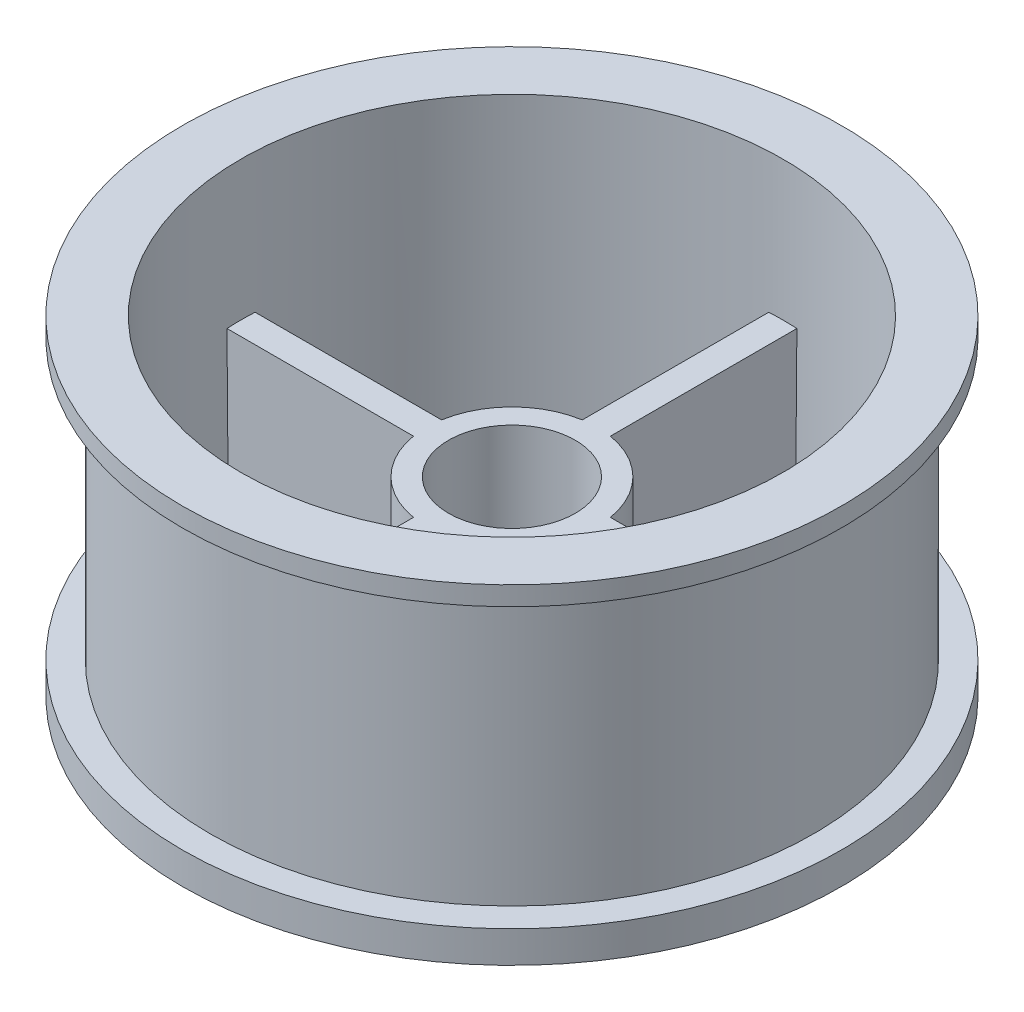
ISO-10303-21;
HEADER;
FILE_DESCRIPTION(('STEP AP214'),'2;1');
FILE_NAME('part.step','',(''),(''),'','','');
FILE_SCHEMA(('AUTOMOTIVE_DESIGN { 1 0 10303 214 1 1 1 1 }'));
ENDSEC;
DATA;
#1=APPLICATION_CONTEXT('core data for automotive mechanical design processes');
#2=APPLICATION_PROTOCOL_DEFINITION('international standard','automotive_design',2000,#1);
#3=PRODUCT_CONTEXT('',#1,'mechanical');
#4=PRODUCT('Part','Part','',(#3));
#5=PRODUCT_RELATED_PRODUCT_CATEGORY('part','',(#4));
#6=PRODUCT_DEFINITION_FORMATION('','',#4);
#7=PRODUCT_DEFINITION_CONTEXT('part definition',#1,'design');
#8=PRODUCT_DEFINITION('design','',#6,#7);
#9=PRODUCT_DEFINITION_SHAPE('','',#8);
#10=(LENGTH_UNIT() NAMED_UNIT(*) SI_UNIT(.MILLI.,.METRE.));
#11=(NAMED_UNIT(*) PLANE_ANGLE_UNIT() SI_UNIT($,.RADIAN.));
#12=(NAMED_UNIT(*) SI_UNIT($,.STERADIAN.) SOLID_ANGLE_UNIT());
#13=UNCERTAINTY_MEASURE_WITH_UNIT(LENGTH_MEASURE(1.E-05),#10,'distance_accuracy_value','');
#14=(GEOMETRIC_REPRESENTATION_CONTEXT(3) GLOBAL_UNCERTAINTY_ASSIGNED_CONTEXT((#13)) GLOBAL_UNIT_ASSIGNED_CONTEXT((#10,
#11,#12)) REPRESENTATION_CONTEXT('',''));
#15=CARTESIAN_POINT('',(0.,0.,0.));
#16=DIRECTION('',(0.,0.,1.));
#17=DIRECTION('',(1.,0.,0.));
#18=AXIS2_PLACEMENT_3D('',#15,#16,#17);
#19=CARTESIAN_POINT('',(0.,2.5,-21.4));
#20=DIRECTION('',(0.,-1.,0.));
#21=DIRECTION('',(0.,0.,-1.));
#22=AXIS2_PLACEMENT_3D('',#19,#20,#21);
#23=PLANE('',#22);
#24=CARTESIAN_POINT('',(9.89949493661167,2.5,-9.89949493661167));
#25=DIRECTION('',(0.,1.,0.));
#26=DIRECTION('',(0.,0.,1.));
#27=AXIS2_PLACEMENT_3D('',#24,#25,#26);
#28=CIRCLE('',#27,6.5);
#29=CARTESIAN_POINT('',(9.89949493661167,2.5,-3.39949493661167));
#30=VERTEX_POINT('',#29);
#31=EDGE_CURVE('E566',#30,#30,#28,.T.);
#32=ORIENTED_EDGE('',*,*,#31,.F.);
#33=EDGE_LOOP('',(#32));
#34=FACE_BOUND('',#33,.T.);
#35=DIRECTION('',(1.,0.,0.));
#36=VECTOR('',#35,1.);
#37=CARTESIAN_POINT('',(0.,2.5,-1.));
#38=LINE('',#37,#36);
#39=CARTESIAN_POINT('',(21.3766227454198,2.5,-1.));
#40=VERTEX_POINT('',#39);
#41=CARTESIAN_POINT('',(6.67551496140934,2.50000000000001,-1.));
#42=VERTEX_POINT('',#41);
#43=EDGE_CURVE('E164',#40,#42,#38,.F.);
#44=ORIENTED_EDGE('',*,*,#43,.F.);
#45=CARTESIAN_POINT('',(0.,2.50000000000001,0.));
#46=DIRECTION('',(0.,1.,0.));
#47=DIRECTION('',(0.,0.,1.));
#48=AXIS2_PLACEMENT_3D('',#45,#46,#47);
#49=CIRCLE('',#48,21.4);
#50=CARTESIAN_POINT('',(1.,2.5,-21.3766227454198));
#51=VERTEX_POINT('',#50);
#52=EDGE_CURVE('E184',#40,#51,#49,.T.);
#53=ORIENTED_EDGE('',*,*,#52,.T.);
#54=DIRECTION('',(0.,0.,1.));
#55=VECTOR('',#54,1.);
#56=CARTESIAN_POINT('',(1.,2.5,-21.4));
#57=LINE('',#56,#55);
#58=CARTESIAN_POINT('',(1.,2.50000000000001,-6.67551496140934));
#59=VERTEX_POINT('',#58);
#60=EDGE_CURVE('E299',#59,#51,#57,.F.);
#61=ORIENTED_EDGE('',*,*,#60,.F.);
#62=CARTESIAN_POINT('',(0.,2.5,0.));
#63=DIRECTION('',(0.,-1.,0.));
#64=DIRECTION('',(0.,0.,-1.));
#65=AXIS2_PLACEMENT_3D('',#62,#63,#64);
#66=CIRCLE('',#65,6.75);
#67=EDGE_CURVE('E221',#42,#59,#66,.F.);
#68=ORIENTED_EDGE('',*,*,#67,.F.);
#69=EDGE_LOOP('',(#44,#53,#61,#68));
#70=FACE_BOUND('',#69,.T.);
#71=ADVANCED_FACE('F37',(#34,#70),#23,.F.);
#72=CARTESIAN_POINT('',(0.,15.,0.));
#73=DIRECTION('',(0.,-1.,0.));
#74=DIRECTION('',(0.,0.,-1.));
#75=AXIS2_PLACEMENT_3D('',#72,#73,#74);
#76=CYLINDRICAL_SURFACE('',#75,6.75);
#77=CARTESIAN_POINT('',(0.,-112.088650129309,0.));
#78=DIRECTION('',(0.,-0.0087265354983741,-0.999961923064171));
#79=DIRECTION('',(0.,-0.999961923064171,0.0087265354983741));
#80=AXIS2_PLACEMENT_3D('',#77,#78,#79);
#81=ELLIPSE('',#80,773.502840990878,6.75);
#82=CARTESIAN_POINT('',(6.65826017688791,15.,-1.10908584738449));
#83=VERTEX_POINT('',#82);
#84=EDGE_CURVE('E162',#42,#83,#81,.F.);
#85=ORIENTED_EDGE('',*,*,#84,.F.);
#86=ORIENTED_EDGE('',*,*,#67,.T.);
#87=CARTESIAN_POINT('',(0.,-112.088650129309,0.));
#88=DIRECTION('',(0.999961923064171,-0.00872653549837395,0.));
#89=DIRECTION('',(-0.00872653549837395,-0.999961923064171,0.));
#90=AXIS2_PLACEMENT_3D('',#87,#88,#89);
#91=ELLIPSE('',#90,773.502840990878,6.75);
#92=CARTESIAN_POINT('',(1.10908584738449,15.,-6.65826017688791));
#93=VERTEX_POINT('',#92);
#94=EDGE_CURVE('E172',#59,#93,#91,.T.);
#95=ORIENTED_EDGE('',*,*,#94,.T.);
#96=CARTESIAN_POINT('',(0.,15.,0.));
#97=DIRECTION('',(0.,1.,0.));
#98=DIRECTION('',(0.,0.,1.));
#99=AXIS2_PLACEMENT_3D('',#96,#97,#98);
#100=CIRCLE('',#99,6.75);
#101=EDGE_CURVE('E155',#83,#93,#100,.T.);
#102=ORIENTED_EDGE('',*,*,#101,.F.);
#103=EDGE_LOOP('',(#85,#86,#95,#102));
#104=FACE_BOUND('',#103,.T.);
#105=ADVANCED_FACE('F170',(#104),#76,.T.);
#106=CARTESIAN_POINT('',(-9.89949493661167,2.5,9.89949493661167));
#107=DIRECTION('',(0.,1.,0.));
#108=DIRECTION('',(0.,0.,-1.));
#109=AXIS2_PLACEMENT_3D('',#106,#107,#108);
#110=CIRCLE('',#109,6.5);
#111=CARTESIAN_POINT('',(-9.89949493661167,2.5,3.39949493661167));
#112=VERTEX_POINT('',#111);
#113=EDGE_CURVE('E564',#112,#112,#110,.T.);
#114=ORIENTED_EDGE('',*,*,#113,.F.);
#115=EDGE_LOOP('',(#114));
#116=FACE_BOUND('',#115,.T.);
#117=DIRECTION('',(-1.,0.,0.));
#118=VECTOR('',#117,1.);
#119=CARTESIAN_POINT('',(0.,2.5,1.));
#120=LINE('',#119,#118);
#121=CARTESIAN_POINT('',(-21.3766227454198,2.5,1.));
#122=VERTEX_POINT('',#121);
#123=CARTESIAN_POINT('',(-6.67551496140934,2.50000000000001,1.));
#124=VERTEX_POINT('',#123);
#125=EDGE_CURVE('E253',#122,#124,#120,.F.);
#126=ORIENTED_EDGE('',*,*,#125,.F.);
#127=CARTESIAN_POINT('',(-1.,2.50000000000001,21.3766227454198));
#128=VERTEX_POINT('',#127);
#129=EDGE_CURVE('E187',#122,#128,#49,.T.);
#130=ORIENTED_EDGE('',*,*,#129,.T.);
#131=DIRECTION('',(0.,0.,-1.));
#132=VECTOR('',#131,1.);
#133=CARTESIAN_POINT('',(-1.,2.5,-21.4));
#134=LINE('',#133,#132);
#135=CARTESIAN_POINT('',(-1.,2.50000000000001,6.67551496140934));
#136=VERTEX_POINT('',#135);
#137=EDGE_CURVE('E284',#136,#128,#134,.F.);
#138=ORIENTED_EDGE('',*,*,#137,.F.);
#139=EDGE_CURVE('E226',#124,#136,#66,.F.);
#140=ORIENTED_EDGE('',*,*,#139,.F.);
#141=EDGE_LOOP('',(#126,#130,#138,#140));
#142=FACE_BOUND('',#141,.T.);
#143=ADVANCED_FACE('F327',(#116,#142),#23,.F.);
#144=CARTESIAN_POINT('',(0.,-112.088650129309,0.));
#145=DIRECTION('',(0.,-0.00872653549837381,0.999961923064171));
#146=DIRECTION('',(0.,-0.999961923064171,-0.00872653549837381));
#147=AXIS2_PLACEMENT_3D('',#144,#145,#146);
#148=ELLIPSE('',#147,773.502840990878,6.75);
#149=CARTESIAN_POINT('',(-6.65826017688791,15.,1.10908584738448));
#150=VERTEX_POINT('',#149);
#151=EDGE_CURVE('E263',#124,#150,#148,.F.);
#152=ORIENTED_EDGE('',*,*,#151,.F.);
#153=ORIENTED_EDGE('',*,*,#139,.T.);
#154=CARTESIAN_POINT('',(0.,-112.088650129309,0.));
#155=DIRECTION('',(-0.999961923064171,-0.00872653549837395,0.));
#156=DIRECTION('',(0.00872653549837395,-0.999961923064171,0.));
#157=AXIS2_PLACEMENT_3D('',#154,#155,#156);
#158=ELLIPSE('',#157,773.502840990878,6.75);
#159=CARTESIAN_POINT('',(-1.10908584738449,15.,6.65826017688791));
#160=VERTEX_POINT('',#159);
#161=EDGE_CURVE('E276',#136,#160,#158,.T.);
#162=ORIENTED_EDGE('',*,*,#161,.T.);
#163=EDGE_CURVE('E176',#150,#160,#100,.T.);
#164=ORIENTED_EDGE('',*,*,#163,.F.);
#165=EDGE_LOOP('',(#152,#153,#162,#164));
#166=FACE_BOUND('',#165,.T.);
#167=ADVANCED_FACE('F332',(#166),#76,.T.);
#168=CARTESIAN_POINT('',(9.89949493661165,2.5,9.89949493661166));
#169=DIRECTION('',(0.,1.,0.));
#170=DIRECTION('',(0.,0.,-1.));
#171=AXIS2_PLACEMENT_3D('',#168,#169,#170);
#172=CIRCLE('',#171,6.5);
#173=CARTESIAN_POINT('',(9.89949493661165,2.5,3.39949493661166));
#174=VERTEX_POINT('',#173);
#175=EDGE_CURVE('E357',#174,#174,#172,.T.);
#176=ORIENTED_EDGE('',*,*,#175,.F.);
#177=EDGE_LOOP('',(#176));
#178=FACE_BOUND('',#177,.T.);
#179=DIRECTION('',(-1.,0.,0.));
#180=VECTOR('',#179,1.);
#181=CARTESIAN_POINT('',(0.,2.5,1.));
#182=LINE('',#181,#180);
#183=CARTESIAN_POINT('',(6.67551496140934,2.50000000000001,1.));
#184=VERTEX_POINT('',#183);
#185=CARTESIAN_POINT('',(21.3766227454198,2.5,1.));
#186=VERTEX_POINT('',#185);
#187=EDGE_CURVE('E256',#184,#186,#182,.F.);
#188=ORIENTED_EDGE('',*,*,#187,.F.);
#189=CARTESIAN_POINT('',(1.,2.50000000000001,6.67551496140934));
#190=VERTEX_POINT('',#189);
#191=EDGE_CURVE('E227',#190,#184,#66,.F.);
#192=ORIENTED_EDGE('',*,*,#191,.F.);
#193=DIRECTION('',(0.,0.,1.));
#194=VECTOR('',#193,1.);
#195=CARTESIAN_POINT('',(1.,2.5,-21.4));
#196=LINE('',#195,#194);
#197=CARTESIAN_POINT('',(1.,2.50000000000001,21.3766227454198));
#198=VERTEX_POINT('',#197);
#199=EDGE_CURVE('E282',#198,#190,#196,.F.);
#200=ORIENTED_EDGE('',*,*,#199,.F.);
#201=EDGE_CURVE('E186',#198,#186,#49,.T.);
#202=ORIENTED_EDGE('',*,*,#201,.T.);
#203=EDGE_LOOP('',(#188,#192,#200,#202));
#204=FACE_BOUND('',#203,.T.);
#205=ADVANCED_FACE('F337',(#178,#204),#23,.F.);
#206=ORIENTED_EDGE('',*,*,#191,.T.);
#207=CARTESIAN_POINT('',(0.,-112.088650129309,0.));
#208=DIRECTION('',(0.,-0.00872653549837381,0.999961923064171));
#209=DIRECTION('',(0.,-0.999961923064171,-0.00872653549837381));
#210=AXIS2_PLACEMENT_3D('',#207,#208,#209);
#211=ELLIPSE('',#210,773.502840990878,6.75);
#212=CARTESIAN_POINT('',(6.65826017688791,15.,1.10908584738448));
#213=VERTEX_POINT('',#212);
#214=EDGE_CURVE('E167',#184,#213,#211,.T.);
#215=ORIENTED_EDGE('',*,*,#214,.T.);
#216=CARTESIAN_POINT('',(1.10908584738449,15.,6.65826017688791));
#217=VERTEX_POINT('',#216);
#218=EDGE_CURVE('E173',#217,#213,#100,.T.);
#219=ORIENTED_EDGE('',*,*,#218,.F.);
#220=CARTESIAN_POINT('',(0.,-112.088650129309,0.));
#221=DIRECTION('',(0.999961923064171,-0.00872653549837395,0.));
#222=DIRECTION('',(-0.00872653549837395,-0.999961923064171,0.));
#223=AXIS2_PLACEMENT_3D('',#220,#221,#222);
#224=ELLIPSE('',#223,773.502840990878,6.75);
#225=EDGE_CURVE('E279',#190,#217,#224,.F.);
#226=ORIENTED_EDGE('',*,*,#225,.F.);
#227=EDGE_LOOP('',(#206,#215,#219,#226));
#228=FACE_BOUND('',#227,.T.);
#229=ADVANCED_FACE('F323',(#228),#76,.T.);
#230=CARTESIAN_POINT('',(-9.89949493661166,2.5,-9.89949493661167));
#231=DIRECTION('',(0.,1.,0.));
#232=DIRECTION('',(0.,0.,1.));
#233=AXIS2_PLACEMENT_3D('',#230,#231,#232);
#234=CIRCLE('',#233,6.5);
#235=CARTESIAN_POINT('',(-9.89949493661166,2.5,-3.39949493661167));
#236=VERTEX_POINT('',#235);
#237=EDGE_CURVE('E577',#236,#236,#234,.T.);
#238=ORIENTED_EDGE('',*,*,#237,.F.);
#239=EDGE_LOOP('',(#238));
#240=FACE_BOUND('',#239,.T.);
#241=DIRECTION('',(1.,0.,0.));
#242=VECTOR('',#241,1.);
#243=CARTESIAN_POINT('',(0.,2.5,-1.));
#244=LINE('',#243,#242);
#245=CARTESIAN_POINT('',(-6.67551496140934,2.50000000000001,-1.));
#246=VERTEX_POINT('',#245);
#247=CARTESIAN_POINT('',(-21.3766227454198,2.5,-1.));
#248=VERTEX_POINT('',#247);
#249=EDGE_CURVE('E245',#246,#248,#244,.F.);
#250=ORIENTED_EDGE('',*,*,#249,.F.);
#251=CARTESIAN_POINT('',(-1.,2.50000000000001,-6.67551496140934));
#252=VERTEX_POINT('',#251);
#253=EDGE_CURVE('E222',#252,#246,#66,.F.);
#254=ORIENTED_EDGE('',*,*,#253,.F.);
#255=DIRECTION('',(0.,0.,-1.));
#256=VECTOR('',#255,1.);
#257=CARTESIAN_POINT('',(-1.,2.5,-21.4));
#258=LINE('',#257,#256);
#259=CARTESIAN_POINT('',(-1.,2.5,-21.3766227454198));
#260=VERTEX_POINT('',#259);
#261=EDGE_CURVE('E295',#260,#252,#258,.F.);
#262=ORIENTED_EDGE('',*,*,#261,.F.);
#263=EDGE_CURVE('E188',#260,#248,#49,.T.);
#264=ORIENTED_EDGE('',*,*,#263,.T.);
#265=EDGE_LOOP('',(#250,#254,#262,#264));
#266=FACE_BOUND('',#265,.T.);
#267=ADVANCED_FACE('F328',(#240,#266),#23,.F.);
#268=CARTESIAN_POINT('',(0.,0.,0.));
#269=DIRECTION('',(0.,1.,0.));
#270=DIRECTION('',(0.,0.,1.));
#271=AXIS2_PLACEMENT_3D('',#268,#269,#270);
#272=PLANE('',#271);
#273=CARTESIAN_POINT('',(-9.89949493661167,0.,9.89949493661167));
#274=DIRECTION('',(0.,1.,0.));
#275=DIRECTION('',(0.,0.,-1.));
#276=AXIS2_PLACEMENT_3D('',#273,#274,#275);
#277=CIRCLE('',#276,6.5);
#278=CARTESIAN_POINT('',(-9.89949493661167,0.,3.39949493661167));
#279=VERTEX_POINT('',#278);
#280=EDGE_CURVE('E561',#279,#279,#277,.T.);
#281=ORIENTED_EDGE('',*,*,#280,.T.);
#282=EDGE_LOOP('',(#281));
#283=FACE_BOUND('',#282,.T.);
#284=CARTESIAN_POINT('',(9.89949493661167,0.,-9.89949493661167));
#285=DIRECTION('',(0.,1.,0.));
#286=DIRECTION('',(0.,0.,1.));
#287=AXIS2_PLACEMENT_3D('',#284,#285,#286);
#288=CIRCLE('',#287,6.5);
#289=CARTESIAN_POINT('',(9.89949493661167,0.,-3.39949493661167));
#290=VERTEX_POINT('',#289);
#291=EDGE_CURVE('E569',#290,#290,#288,.T.);
#292=ORIENTED_EDGE('',*,*,#291,.T.);
#293=EDGE_LOOP('',(#292));
#294=FACE_BOUND('',#293,.T.);
#295=CARTESIAN_POINT('',(9.89949493661165,0.,9.89949493661166));
#296=DIRECTION('',(0.,1.,0.));
#297=DIRECTION('',(0.,0.,-1.));
#298=AXIS2_PLACEMENT_3D('',#295,#296,#297);
#299=CIRCLE('',#298,6.5);
#300=CARTESIAN_POINT('',(9.89949493661165,0.,3.39949493661166));
#301=VERTEX_POINT('',#300);
#302=EDGE_CURVE('E574',#301,#301,#299,.T.);
#303=ORIENTED_EDGE('',*,*,#302,.T.);
#304=EDGE_LOOP('',(#303));
#305=FACE_BOUND('',#304,.T.);
#306=CARTESIAN_POINT('',(-9.89949493661166,0.,-9.89949493661167));
#307=DIRECTION('',(0.,1.,0.));
#308=DIRECTION('',(0.,0.,1.));
#309=AXIS2_PLACEMENT_3D('',#306,#307,#308);
#310=CIRCLE('',#309,6.5);
#311=CARTESIAN_POINT('',(-9.89949493661166,0.,-3.39949493661167));
#312=VERTEX_POINT('',#311);
#313=EDGE_CURVE('E579',#312,#312,#310,.T.);
#314=ORIENTED_EDGE('',*,*,#313,.T.);
#315=EDGE_LOOP('',(#314));
#316=FACE_BOUND('',#315,.T.);
#317=CARTESIAN_POINT('',(0.,0.,0.));
#318=DIRECTION('',(0.,1.,0.));
#319=DIRECTION('',(0.,0.,1.));
#320=AXIS2_PLACEMENT_3D('',#317,#318,#319);
#321=CIRCLE('',#320,4.25);
#322=CARTESIAN_POINT('',(0.,0.,4.25));
#323=VERTEX_POINT('',#322);
#324=EDGE_CURVE('E302',#323,#323,#321,.T.);
#325=ORIENTED_EDGE('',*,*,#324,.T.);
#326=EDGE_LOOP('',(#325));
#327=FACE_BOUND('',#326,.T.);
#328=CARTESIAN_POINT('',(0.,0.,0.));
#329=DIRECTION('',(0.,1.,0.));
#330=DIRECTION('',(0.,0.,1.));
#331=AXIS2_PLACEMENT_3D('',#328,#329,#330);
#332=CIRCLE('',#331,26.);
#333=CARTESIAN_POINT('',(0.,0.,26.));
#334=VERTEX_POINT('',#333);
#335=EDGE_CURVE('E218',#334,#334,#332,.T.);
#336=ORIENTED_EDGE('',*,*,#335,.F.);
#337=EDGE_LOOP('',(#336));
#338=FACE_BOUND('',#337,.T.);
#339=ADVANCED_FACE('F39',(#283,#294,#305,#316,#327,#338),#272,.F.);
#340=CARTESIAN_POINT('',(0.,2.5,0.));
#341=DIRECTION('',(0.,1.,0.));
#342=DIRECTION('',(0.,0.,1.));
#343=AXIS2_PLACEMENT_3D('',#340,#341,#342);
#344=CYLINDRICAL_SURFACE('',#343,26.);
#345=ORIENTED_EDGE('',*,*,#335,.T.);
#346=EDGE_LOOP('',(#345));
#347=FACE_BOUND('',#346,.T.);
#348=CARTESIAN_POINT('',(0.,2.5,0.));
#349=DIRECTION('',(0.,1.,0.));
#350=DIRECTION('',(0.,0.,1.));
#351=AXIS2_PLACEMENT_3D('',#348,#349,#350);
#352=CIRCLE('',#351,26.);
#353=CARTESIAN_POINT('',(0.,2.50000000000001,26.));
#354=VERTEX_POINT('',#353);
#355=EDGE_CURVE('E215',#354,#354,#352,.T.);
#356=ORIENTED_EDGE('',*,*,#355,.F.);
#357=EDGE_LOOP('',(#356));
#358=FACE_BOUND('',#357,.T.);
#359=ADVANCED_FACE('F344',(#347,#358),#344,.T.);
#360=CARTESIAN_POINT('',(0.,2.5,-26.));
#361=DIRECTION('',(0.,-1.,0.));
#362=DIRECTION('',(0.,0.,-1.));
#363=AXIS2_PLACEMENT_3D('',#360,#361,#362);
#364=PLANE('',#363);
#365=ORIENTED_EDGE('',*,*,#355,.T.);
#366=EDGE_LOOP('',(#365));
#367=FACE_BOUND('',#366,.T.);
#368=CARTESIAN_POINT('',(0.,2.5,0.));
#369=DIRECTION('',(0.,1.,0.));
#370=DIRECTION('',(0.,0.,1.));
#371=AXIS2_PLACEMENT_3D('',#368,#369,#370);
#372=CIRCLE('',#371,23.8);
#373=CARTESIAN_POINT('',(0.,2.50000000000001,23.8));
#374=VERTEX_POINT('',#373);
#375=EDGE_CURVE('E212',#374,#374,#372,.T.);
#376=ORIENTED_EDGE('',*,*,#375,.F.);
#377=EDGE_LOOP('',(#376));
#378=FACE_BOUND('',#377,.T.);
#379=ADVANCED_FACE('F604',(#367,#378),#364,.F.);
#380=CARTESIAN_POINT('',(0.,2.5,0.));
#381=DIRECTION('',(0.,1.,0.));
#382=DIRECTION('',(0.,0.,1.));
#383=AXIS2_PLACEMENT_3D('',#380,#381,#382);
#384=CYLINDRICAL_SURFACE('',#383,23.8);
#385=ORIENTED_EDGE('',*,*,#375,.T.);
#386=EDGE_LOOP('',(#385));
#387=FACE_BOUND('',#386,.T.);
#388=CARTESIAN_POINT('',(0.,23.2298294077828,0.));
#389=DIRECTION('',(0.,1.,0.));
#390=DIRECTION('',(0.,0.,1.));
#391=AXIS2_PLACEMENT_3D('',#388,#389,#390);
#392=CIRCLE('',#391,23.8);
#393=CARTESIAN_POINT('',(0.,23.2298294077828,23.8));
#394=VERTEX_POINT('',#393);
#395=EDGE_CURVE('E209',#394,#394,#392,.T.);
#396=ORIENTED_EDGE('',*,*,#395,.F.);
#397=EDGE_LOOP('',(#396));
#398=FACE_BOUND('',#397,.T.);
#399=ADVANCED_FACE('F609',(#387,#398),#384,.T.);
#400=CARTESIAN_POINT('',(0.,23.2298294077828,0.));
#401=DIRECTION('',(0.,1.,0.));
#402=DIRECTION('',(0.,0.,1.));
#403=AXIS2_PLACEMENT_3D('',#400,#401,#402);
#404=CONICAL_SURFACE('',#403,23.8,1.0471975511966);
#405=CARTESIAN_POINT('',(0.,24.5,0.));
#406=DIRECTION('',(0.,1.,0.));
#407=DIRECTION('',(0.,0.,1.));
#408=AXIS2_PLACEMENT_3D('',#405,#406,#407);
#409=CIRCLE('',#408,26.);
#410=CARTESIAN_POINT('',(0.,24.5,26.));
#411=VERTEX_POINT('',#410);
#412=EDGE_CURVE('E204',#411,#411,#409,.T.);
#413=ORIENTED_EDGE('',*,*,#412,.F.);
#414=EDGE_LOOP('',(#413));
#415=FACE_BOUND('',#414,.T.);
#416=ORIENTED_EDGE('',*,*,#395,.T.);
#417=EDGE_LOOP('',(#416));
#418=FACE_BOUND('',#417,.T.);
#419=ADVANCED_FACE('F615',(#415,#418),#404,.T.);
#420=CARTESIAN_POINT('',(0.,2.5,0.));
#421=DIRECTION('',(0.,1.,0.));
#422=DIRECTION('',(0.,0.,1.));
#423=AXIS2_PLACEMENT_3D('',#420,#421,#422);
#424=CYLINDRICAL_SURFACE('',#423,26.);
#425=CARTESIAN_POINT('',(0.,26.,0.));
#426=DIRECTION('',(0.,1.,0.));
#427=DIRECTION('',(0.,0.,1.));
#428=AXIS2_PLACEMENT_3D('',#425,#426,#427);
#429=CIRCLE('',#428,26.);
#430=CARTESIAN_POINT('',(0.,26.,26.));
#431=VERTEX_POINT('',#430);
#432=EDGE_CURVE('E200',#431,#431,#429,.T.);
#433=ORIENTED_EDGE('',*,*,#432,.F.);
#434=EDGE_LOOP('',(#433));
#435=FACE_BOUND('',#434,.T.);
#436=ORIENTED_EDGE('',*,*,#412,.T.);
#437=EDGE_LOOP('',(#436));
#438=FACE_BOUND('',#437,.T.);
#439=ADVANCED_FACE('F620',(#435,#438),#424,.T.);
#440=CARTESIAN_POINT('',(0.,26.,-26.));
#441=DIRECTION('',(0.,-1.,0.));
#442=DIRECTION('',(0.,0.,-1.));
#443=AXIS2_PLACEMENT_3D('',#440,#441,#442);
#444=PLANE('',#443);
#445=CARTESIAN_POINT('',(0.,26.,0.));
#446=DIRECTION('',(0.,1.,0.));
#447=DIRECTION('',(0.,0.,1.));
#448=AXIS2_PLACEMENT_3D('',#445,#446,#447);
#449=CIRCLE('',#448,21.4);
#450=CARTESIAN_POINT('',(0.,26.,21.4));
#451=VERTEX_POINT('',#450);
#452=EDGE_CURVE('E196',#451,#451,#449,.T.);
#453=ORIENTED_EDGE('',*,*,#452,.F.);
#454=EDGE_LOOP('',(#453));
#455=FACE_BOUND('',#454,.T.);
#456=ORIENTED_EDGE('',*,*,#432,.T.);
#457=EDGE_LOOP('',(#456));
#458=FACE_BOUND('',#457,.T.);
#459=ADVANCED_FACE('F626',(#455,#458),#444,.F.);
#460=CARTESIAN_POINT('',(0.,2.5,0.));
#461=DIRECTION('',(0.,1.,0.));
#462=DIRECTION('',(0.,0.,1.));
#463=AXIS2_PLACEMENT_3D('',#460,#461,#462);
#464=CYLINDRICAL_SURFACE('',#463,21.4);
#465=ORIENTED_EDGE('',*,*,#52,.F.);
#466=CARTESIAN_POINT('',(0.,-112.088650129309,0.));
#467=DIRECTION('',(0.,-0.0087265354983741,-0.999961923064171));
#468=DIRECTION('',(0.,0.999961923064171,-0.0087265354983741));
#469=AXIS2_PLACEMENT_3D('',#466,#467,#468);
#470=ELLIPSE('',#469,2452.29048847478,21.4);
#471=CARTESIAN_POINT('',(21.3712406889055,15.,-1.10908584738449));
#472=VERTEX_POINT('',#471);
#473=EDGE_CURVE('E11',#40,#472,#470,.F.);
#474=ORIENTED_EDGE('',*,*,#473,.T.);
#475=CARTESIAN_POINT('',(0.,15.,0.));
#476=DIRECTION('',(0.,1.,0.));
#477=DIRECTION('',(0.,0.,1.));
#478=AXIS2_PLACEMENT_3D('',#475,#476,#477);
#479=CIRCLE('',#478,21.4);
#480=CARTESIAN_POINT('',(21.3712406889055,15.,1.10908584738448));
#481=VERTEX_POINT('',#480);
#482=EDGE_CURVE('E158',#472,#481,#479,.F.);
#483=ORIENTED_EDGE('',*,*,#482,.T.);
#484=CARTESIAN_POINT('',(0.,-112.088650129309,0.));
#485=DIRECTION('',(0.,-0.00872653549837381,0.999961923064171));
#486=DIRECTION('',(0.,0.999961923064171,0.00872653549837381));
#487=AXIS2_PLACEMENT_3D('',#484,#485,#486);
#488=ELLIPSE('',#487,2452.29048847478,21.4);
#489=EDGE_CURVE('E41',#186,#481,#488,.T.);
#490=ORIENTED_EDGE('',*,*,#489,.F.);
#491=ORIENTED_EDGE('',*,*,#201,.F.);
#492=CARTESIAN_POINT('',(0.,-112.088650129309,0.));
#493=DIRECTION('',(0.999961923064171,-0.00872653549837395,0.));
#494=DIRECTION('',(0.00872653549837395,0.999961923064171,0.));
#495=AXIS2_PLACEMENT_3D('',#492,#493,#494);
#496=ELLIPSE('',#495,2452.29048847478,21.4);
#497=CARTESIAN_POINT('',(1.10908584738449,15.,21.3712406889055));
#498=VERTEX_POINT('',#497);
#499=EDGE_CURVE('E234',#198,#498,#496,.F.);
#500=ORIENTED_EDGE('',*,*,#499,.T.);
#501=CARTESIAN_POINT('',(0.,15.,0.));
#502=DIRECTION('',(0.,1.,0.));
#503=DIRECTION('',(0.,0.,1.));
#504=AXIS2_PLACEMENT_3D('',#501,#502,#503);
#505=CIRCLE('',#504,21.4);
#506=CARTESIAN_POINT('',(-1.10908584738449,15.,21.3712406889055));
#507=VERTEX_POINT('',#506);
#508=EDGE_CURVE('E271',#498,#507,#505,.F.);
#509=ORIENTED_EDGE('',*,*,#508,.T.);
#510=CARTESIAN_POINT('',(0.,-112.088650129309,0.));
#511=DIRECTION('',(-0.999961923064171,-0.00872653549837395,0.));
#512=DIRECTION('',(-0.00872653549837395,0.999961923064171,0.));
#513=AXIS2_PLACEMENT_3D('',#510,#511,#512);
#514=ELLIPSE('',#513,2452.29048847478,21.4);
#515=EDGE_CURVE('E231',#128,#507,#514,.T.);
#516=ORIENTED_EDGE('',*,*,#515,.F.);
#517=ORIENTED_EDGE('',*,*,#129,.F.);
#518=CARTESIAN_POINT('',(0.,-112.088650129309,0.));
#519=DIRECTION('',(0.,-0.00872653549837381,0.999961923064171));
#520=DIRECTION('',(0.,0.999961923064171,0.00872653549837381));
#521=AXIS2_PLACEMENT_3D('',#518,#519,#520);
#522=ELLIPSE('',#521,2452.29048847478,21.4);
#523=CARTESIAN_POINT('',(-21.3712406889055,15.,1.10908584738448));
#524=VERTEX_POINT('',#523);
#525=EDGE_CURVE('E240',#122,#524,#522,.F.);
#526=ORIENTED_EDGE('',*,*,#525,.T.);
#527=CARTESIAN_POINT('',(0.,15.,0.));
#528=DIRECTION('',(0.,1.,0.));
#529=DIRECTION('',(0.,0.,1.));
#530=AXIS2_PLACEMENT_3D('',#527,#528,#529);
#531=CIRCLE('',#530,21.4);
#532=CARTESIAN_POINT('',(-21.3712406889055,15.,-1.10908584738449));
#533=VERTEX_POINT('',#532);
#534=EDGE_CURVE('E250',#524,#533,#531,.F.);
#535=ORIENTED_EDGE('',*,*,#534,.T.);
#536=CARTESIAN_POINT('',(0.,-112.088650129309,0.));
#537=DIRECTION('',(0.,-0.0087265354983741,-0.999961923064171));
#538=DIRECTION('',(0.,0.999961923064171,-0.0087265354983741));
#539=AXIS2_PLACEMENT_3D('',#536,#537,#538);
#540=ELLIPSE('',#539,2452.29048847478,21.4);
#541=EDGE_CURVE('E237',#248,#533,#540,.T.);
#542=ORIENTED_EDGE('',*,*,#541,.F.);
#543=ORIENTED_EDGE('',*,*,#263,.F.);
#544=CARTESIAN_POINT('',(0.,-112.088650129309,0.));
#545=DIRECTION('',(-0.999961923064171,-0.00872653549837395,0.));
#546=DIRECTION('',(-0.00872653549837395,0.999961923064171,0.));
#547=AXIS2_PLACEMENT_3D('',#544,#545,#546);
#548=ELLIPSE('',#547,2452.29048847478,21.4);
#549=CARTESIAN_POINT('',(-1.10908584738449,15.,-21.3712406889055));
#550=VERTEX_POINT('',#549);
#551=EDGE_CURVE('E228',#260,#550,#548,.F.);
#552=ORIENTED_EDGE('',*,*,#551,.T.);
#553=CARTESIAN_POINT('',(0.,15.,0.));
#554=DIRECTION('',(0.,1.,0.));
#555=DIRECTION('',(0.,0.,1.));
#556=AXIS2_PLACEMENT_3D('',#553,#554,#555);
#557=CIRCLE('',#556,21.4);
#558=CARTESIAN_POINT('',(1.10908584738449,15.,-21.3712406889055));
#559=VERTEX_POINT('',#558);
#560=EDGE_CURVE('E297',#550,#559,#557,.F.);
#561=ORIENTED_EDGE('',*,*,#560,.T.);
#562=CARTESIAN_POINT('',(0.,-112.088650129309,0.));
#563=DIRECTION('',(0.999961923064171,-0.00872653549837395,0.));
#564=DIRECTION('',(0.00872653549837395,0.999961923064171,0.));
#565=AXIS2_PLACEMENT_3D('',#562,#563,#564);
#566=ELLIPSE('',#565,2452.29048847478,21.4);
#567=EDGE_CURVE('E225',#51,#559,#566,.T.);
#568=ORIENTED_EDGE('',*,*,#567,.F.);
#569=EDGE_LOOP('',(#465,#474,#483,#490,#491,#500,#509,#516,#517,#526,#535,#542,#543,#552,#561,#568));
#570=FACE_BOUND('',#569,.T.);
#571=ORIENTED_EDGE('',*,*,#452,.T.);
#572=EDGE_LOOP('',(#571));
#573=FACE_BOUND('',#572,.T.);
#574=ADVANCED_FACE('F247',(#570,#573),#464,.F.);
#575=ORIENTED_EDGE('',*,*,#253,.T.);
#576=CARTESIAN_POINT('',(0.,-112.088650129309,0.));
#577=DIRECTION('',(0.,-0.0087265354983741,-0.999961923064171));
#578=DIRECTION('',(0.,-0.999961923064171,0.0087265354983741));
#579=AXIS2_PLACEMENT_3D('',#576,#577,#578);
#580=ELLIPSE('',#579,773.502840990878,6.75);
#581=CARTESIAN_POINT('',(-6.65826017688791,15.,-1.10908584738449));
#582=VERTEX_POINT('',#581);
#583=EDGE_CURVE('E258',#246,#582,#580,.T.);
#584=ORIENTED_EDGE('',*,*,#583,.T.);
#585=CARTESIAN_POINT('',(-1.10908584738449,15.,-6.65826017688791));
#586=VERTEX_POINT('',#585);
#587=EDGE_CURVE('E177',#586,#582,#100,.T.);
#588=ORIENTED_EDGE('',*,*,#587,.F.);
#589=CARTESIAN_POINT('',(0.,-112.088650129309,0.));
#590=DIRECTION('',(-0.999961923064171,-0.00872653549837395,0.));
#591=DIRECTION('',(0.00872653549837395,-0.999961923064171,0.));
#592=AXIS2_PLACEMENT_3D('',#589,#590,#591);
#593=ELLIPSE('',#592,773.502840990878,6.75);
#594=EDGE_CURVE('E292',#252,#586,#593,.F.);
#595=ORIENTED_EDGE('',*,*,#594,.F.);
#596=EDGE_LOOP('',(#575,#584,#588,#595));
#597=FACE_BOUND('',#596,.T.);
#598=ADVANCED_FACE('F312',(#597),#76,.T.);
#599=CARTESIAN_POINT('',(0.,15.,0.));
#600=DIRECTION('',(0.,1.,0.));
#601=DIRECTION('',(0.,0.,1.));
#602=AXIS2_PLACEMENT_3D('',#599,#600,#601);
#603=PLANE('',#602);
#604=CARTESIAN_POINT('',(0.,15.,0.));
#605=DIRECTION('',(0.,1.,0.));
#606=DIRECTION('',(0.,0.,1.));
#607=AXIS2_PLACEMENT_3D('',#604,#605,#606);
#608=CIRCLE('',#607,5.);
#609=CARTESIAN_POINT('',(0.,15.,5.));
#610=VERTEX_POINT('',#609);
#611=EDGE_CURVE('E180',#610,#610,#608,.T.);
#612=ORIENTED_EDGE('',*,*,#611,.F.);
#613=EDGE_LOOP('',(#612));
#614=FACE_BOUND('',#613,.T.);
#615=ORIENTED_EDGE('',*,*,#587,.T.);
#616=DIRECTION('',(1.,0.,0.));
#617=VECTOR('',#616,1.);
#618=CARTESIAN_POINT('',(-9.15967949309711,15.,-1.10908584738449));
#619=LINE('',#618,#617);
#620=EDGE_CURVE('E60',#582,#533,#619,.F.);
#621=ORIENTED_EDGE('',*,*,#620,.T.);
#622=ORIENTED_EDGE('',*,*,#534,.F.);
#623=DIRECTION('',(1.,0.,0.));
#624=VECTOR('',#623,1.);
#625=CARTESIAN_POINT('',(-9.15967949309711,15.,1.10908584738448));
#626=LINE('',#625,#624);
#627=EDGE_CURVE('E255',#150,#524,#626,.F.);
#628=ORIENTED_EDGE('',*,*,#627,.F.);
#629=ORIENTED_EDGE('',*,*,#163,.T.);
#630=DIRECTION('',(0.,0.,1.));
#631=VECTOR('',#630,1.);
#632=CARTESIAN_POINT('',(-1.10908584738449,15.,11.0021437589499));
#633=LINE('',#632,#631);
#634=EDGE_CURVE('E268',#507,#160,#633,.F.);
#635=ORIENTED_EDGE('',*,*,#634,.F.);
#636=ORIENTED_EDGE('',*,*,#508,.F.);
#637=DIRECTION('',(0.,0.,-1.));
#638=VECTOR('',#637,1.);
#639=CARTESIAN_POINT('',(1.10908584738449,15.,11.0021437589499));
#640=LINE('',#639,#638);
#641=EDGE_CURVE('E269',#217,#498,#640,.F.);
#642=ORIENTED_EDGE('',*,*,#641,.F.);
#643=ORIENTED_EDGE('',*,*,#218,.T.);
#644=DIRECTION('',(1.,0.,0.));
#645=VECTOR('',#644,1.);
#646=CARTESIAN_POINT('',(9.26496316543157,15.,1.10908584738448));
#647=LINE('',#646,#645);
#648=EDGE_CURVE('E159',#481,#213,#647,.F.);
#649=ORIENTED_EDGE('',*,*,#648,.F.);
#650=ORIENTED_EDGE('',*,*,#482,.F.);
#651=DIRECTION('',(1.,0.,0.));
#652=VECTOR('',#651,1.);
#653=CARTESIAN_POINT('',(9.26496316543157,15.,-1.10908584738449));
#654=LINE('',#653,#652);
#655=EDGE_CURVE('E52',#83,#472,#654,.T.);
#656=ORIENTED_EDGE('',*,*,#655,.F.);
#657=ORIENTED_EDGE('',*,*,#101,.T.);
#658=DIRECTION('',(0.,0.,1.));
#659=VECTOR('',#658,1.);
#660=CARTESIAN_POINT('',(1.10908584738449,15.,-9.73873969093665));
#661=LINE('',#660,#659);
#662=EDGE_CURVE('E287',#93,#559,#661,.F.);
#663=ORIENTED_EDGE('',*,*,#662,.T.);
#664=ORIENTED_EDGE('',*,*,#560,.F.);
#665=DIRECTION('',(0.,0.,1.));
#666=VECTOR('',#665,1.);
#667=CARTESIAN_POINT('',(-1.10908584738449,15.,-9.73873969093665));
#668=LINE('',#667,#666);
#669=EDGE_CURVE('E288',#586,#550,#668,.F.);
#670=ORIENTED_EDGE('',*,*,#669,.F.);
#671=EDGE_LOOP('',(#615,#621,#622,#628,#629,#635,#636,#642,#643,#649,#650,#656,#657,#663,#664,#670));
#672=FACE_BOUND('',#671,.T.);
#673=ADVANCED_FACE('F152',(#614,#672),#603,.T.);
#674=CARTESIAN_POINT('',(0.,5.,0.));
#675=DIRECTION('',(0.,1.,0.));
#676=DIRECTION('',(0.,0.,1.));
#677=AXIS2_PLACEMENT_3D('',#674,#675,#676);
#678=CYLINDRICAL_SURFACE('',#677,5.);
#679=CARTESIAN_POINT('',(0.,5.,0.));
#680=DIRECTION('',(0.,1.,0.));
#681=DIRECTION('',(0.,0.,1.));
#682=AXIS2_PLACEMENT_3D('',#679,#680,#681);
#683=CIRCLE('',#682,5.);
#684=CARTESIAN_POINT('',(0.,5.,5.));
#685=VERTEX_POINT('',#684);
#686=EDGE_CURVE('E174',#685,#685,#683,.T.);
#687=ORIENTED_EDGE('',*,*,#686,.F.);
#688=EDGE_LOOP('',(#687));
#689=FACE_BOUND('',#688,.T.);
#690=ORIENTED_EDGE('',*,*,#611,.T.);
#691=EDGE_LOOP('',(#690));
#692=FACE_BOUND('',#691,.T.);
#693=ADVANCED_FACE('F309',(#689,#692),#678,.F.);
#694=CARTESIAN_POINT('',(0.,5.,0.));
#695=DIRECTION('',(0.,1.,0.));
#696=DIRECTION('',(0.,0.,1.));
#697=AXIS2_PLACEMENT_3D('',#694,#695,#696);
#698=PLANE('',#697);
#699=CARTESIAN_POINT('',(0.,5.,0.));
#700=DIRECTION('',(0.,1.,0.));
#701=DIRECTION('',(0.,0.,1.));
#702=AXIS2_PLACEMENT_3D('',#699,#700,#701);
#703=CIRCLE('',#702,4.25);
#704=CARTESIAN_POINT('',(0.,5.,4.25));
#705=VERTEX_POINT('',#704);
#706=EDGE_CURVE('E301',#705,#705,#703,.T.);
#707=ORIENTED_EDGE('',*,*,#706,.F.);
#708=EDGE_LOOP('',(#707));
#709=FACE_BOUND('',#708,.T.);
#710=ORIENTED_EDGE('',*,*,#686,.T.);
#711=EDGE_LOOP('',(#710));
#712=FACE_BOUND('',#711,.T.);
#713=ADVANCED_FACE('F318',(#709,#712),#698,.T.);
#714=CARTESIAN_POINT('',(0.,0.,0.));
#715=DIRECTION('',(0.,1.,0.));
#716=DIRECTION('',(0.,0.,1.));
#717=AXIS2_PLACEMENT_3D('',#714,#715,#716);
#718=CYLINDRICAL_SURFACE('',#717,4.25);
#719=ORIENTED_EDGE('',*,*,#324,.F.);
#720=EDGE_LOOP('',(#719));
#721=FACE_BOUND('',#720,.T.);
#722=ORIENTED_EDGE('',*,*,#706,.T.);
#723=EDGE_LOOP('',(#722));
#724=FACE_BOUND('',#723,.T.);
#725=ADVANCED_FACE('F379',(#721,#724),#718,.F.);
#726=CARTESIAN_POINT('',(-1.10908584738449,15.,-9.73873969093665));
#727=DIRECTION('',(-0.999961923064171,-0.00872653549837395,0.));
#728=DIRECTION('',(0.00872653549837395,-0.999961923064171,0.));
#729=AXIS2_PLACEMENT_3D('',#726,#727,#728);
#730=PLANE('',#729);
#731=ORIENTED_EDGE('',*,*,#669,.T.);
#732=ORIENTED_EDGE('',*,*,#551,.F.);
#733=ORIENTED_EDGE('',*,*,#261,.T.);
#734=ORIENTED_EDGE('',*,*,#594,.T.);
#735=EDGE_LOOP('',(#731,#732,#733,#734));
#736=FACE_BOUND('',#735,.T.);
#737=ADVANCED_FACE('F375',(#736),#730,.T.);
#738=CARTESIAN_POINT('',(1.10908584738449,15.,-9.73873969093665));
#739=DIRECTION('',(0.999961923064171,-0.00872653549837395,0.));
#740=DIRECTION('',(0.00872653549837395,0.999961923064171,0.));
#741=AXIS2_PLACEMENT_3D('',#738,#739,#740);
#742=PLANE('',#741);
#743=ORIENTED_EDGE('',*,*,#662,.F.);
#744=ORIENTED_EDGE('',*,*,#94,.F.);
#745=ORIENTED_EDGE('',*,*,#60,.T.);
#746=ORIENTED_EDGE('',*,*,#567,.T.);
#747=EDGE_LOOP('',(#743,#744,#745,#746));
#748=FACE_BOUND('',#747,.T.);
#749=ADVANCED_FACE('F372',(#748),#742,.T.);
#750=CARTESIAN_POINT('',(1.10908584738449,15.,11.0021437589499));
#751=DIRECTION('',(0.999961923064171,-0.00872653549837395,0.));
#752=DIRECTION('',(0.00872653549837395,0.999961923064171,0.));
#753=AXIS2_PLACEMENT_3D('',#750,#751,#752);
#754=PLANE('',#753);
#755=ORIENTED_EDGE('',*,*,#641,.T.);
#756=ORIENTED_EDGE('',*,*,#499,.F.);
#757=ORIENTED_EDGE('',*,*,#199,.T.);
#758=ORIENTED_EDGE('',*,*,#225,.T.);
#759=EDGE_LOOP('',(#755,#756,#757,#758));
#760=FACE_BOUND('',#759,.T.);
#761=ADVANCED_FACE('F385',(#760),#754,.T.);
#762=CARTESIAN_POINT('',(-1.10908584738449,15.,11.0021437589499));
#763=DIRECTION('',(-0.999961923064171,-0.00872653549837395,0.));
#764=DIRECTION('',(0.00872653549837395,-0.999961923064171,0.));
#765=AXIS2_PLACEMENT_3D('',#762,#763,#764);
#766=PLANE('',#765);
#767=ORIENTED_EDGE('',*,*,#137,.T.);
#768=ORIENTED_EDGE('',*,*,#515,.T.);
#769=ORIENTED_EDGE('',*,*,#634,.T.);
#770=ORIENTED_EDGE('',*,*,#161,.F.);
#771=EDGE_LOOP('',(#767,#768,#769,#770));
#772=FACE_BOUND('',#771,.T.);
#773=ADVANCED_FACE('F390',(#772),#766,.T.);
#774=CARTESIAN_POINT('',(-9.15967949309711,15.,1.10908584738448));
#775=DIRECTION('',(0.,-0.00872653549837381,0.999961923064171));
#776=DIRECTION('',(0.,-0.999961923064171,-0.00872653549837381));
#777=AXIS2_PLACEMENT_3D('',#774,#775,#776);
#778=PLANE('',#777);
#779=ORIENTED_EDGE('',*,*,#627,.T.);
#780=ORIENTED_EDGE('',*,*,#525,.F.);
#781=ORIENTED_EDGE('',*,*,#125,.T.);
#782=ORIENTED_EDGE('',*,*,#151,.T.);
#783=EDGE_LOOP('',(#779,#780,#781,#782));
#784=FACE_BOUND('',#783,.T.);
#785=ADVANCED_FACE('F441',(#784),#778,.T.);
#786=CARTESIAN_POINT('',(-9.15967949309711,15.,-1.10908584738449));
#787=DIRECTION('',(0.,-0.0087265354983741,-0.999961923064171));
#788=DIRECTION('',(0.,0.999961923064171,-0.0087265354983741));
#789=AXIS2_PLACEMENT_3D('',#786,#787,#788);
#790=PLANE('',#789);
#791=ORIENTED_EDGE('',*,*,#620,.F.);
#792=ORIENTED_EDGE('',*,*,#583,.F.);
#793=ORIENTED_EDGE('',*,*,#249,.T.);
#794=ORIENTED_EDGE('',*,*,#541,.T.);
#795=EDGE_LOOP('',(#791,#792,#793,#794));
#796=FACE_BOUND('',#795,.T.);
#797=ADVANCED_FACE('F244',(#796),#790,.T.);
#798=CARTESIAN_POINT('',(9.26496316543157,15.,-1.10908584738449));
#799=DIRECTION('',(0.,-0.0087265354983741,-0.999961923064171));
#800=DIRECTION('',(0.,0.999961923064171,-0.0087265354983741));
#801=AXIS2_PLACEMENT_3D('',#798,#799,#800);
#802=PLANE('',#801);
#803=ORIENTED_EDGE('',*,*,#655,.T.);
#804=ORIENTED_EDGE('',*,*,#473,.F.);
#805=ORIENTED_EDGE('',*,*,#43,.T.);
#806=ORIENTED_EDGE('',*,*,#84,.T.);
#807=EDGE_LOOP('',(#803,#804,#805,#806));
#808=FACE_BOUND('',#807,.T.);
#809=ADVANCED_FACE('F163',(#808),#802,.T.);
#810=CARTESIAN_POINT('',(9.26496316543157,15.,1.10908584738448));
#811=DIRECTION('',(0.,-0.00872653549837381,0.999961923064171));
#812=DIRECTION('',(0.,-0.999961923064171,-0.00872653549837381));
#813=AXIS2_PLACEMENT_3D('',#810,#811,#812);
#814=PLANE('',#813);
#815=ORIENTED_EDGE('',*,*,#187,.T.);
#816=ORIENTED_EDGE('',*,*,#489,.T.);
#817=ORIENTED_EDGE('',*,*,#648,.T.);
#818=ORIENTED_EDGE('',*,*,#214,.F.);
#819=EDGE_LOOP('',(#815,#816,#817,#818));
#820=FACE_BOUND('',#819,.T.);
#821=ADVANCED_FACE('F366',(#820),#814,.T.);
#822=CARTESIAN_POINT('',(-9.89949493661166,0.,-9.89949493661167));
#823=DIRECTION('',(0.,1.,0.));
#824=DIRECTION('',(0.,0.,1.));
#825=AXIS2_PLACEMENT_3D('',#822,#823,#824);
#826=CYLINDRICAL_SURFACE('',#825,6.5);
#827=ORIENTED_EDGE('',*,*,#313,.F.);
#828=EDGE_LOOP('',(#827));
#829=FACE_BOUND('',#828,.T.);
#830=ORIENTED_EDGE('',*,*,#237,.T.);
#831=EDGE_LOOP('',(#830));
#832=FACE_BOUND('',#831,.T.);
#833=ADVANCED_FACE('F482',(#829,#832),#826,.F.);
#834=CARTESIAN_POINT('',(9.89949493661165,0.,9.89949493661166));
#835=DIRECTION('',(0.,1.,0.));
#836=DIRECTION('',(0.,0.,1.));
#837=AXIS2_PLACEMENT_3D('',#834,#835,#836);
#838=CYLINDRICAL_SURFACE('',#837,6.5);
#839=ORIENTED_EDGE('',*,*,#302,.F.);
#840=EDGE_LOOP('',(#839));
#841=FACE_BOUND('',#840,.T.);
#842=ORIENTED_EDGE('',*,*,#175,.T.);
#843=EDGE_LOOP('',(#842));
#844=FACE_BOUND('',#843,.T.);
#845=ADVANCED_FACE('F524',(#841,#844),#838,.F.);
#846=CARTESIAN_POINT('',(9.89949493661167,0.,-9.89949493661167));
#847=DIRECTION('',(0.,1.,0.));
#848=DIRECTION('',(0.,0.,1.));
#849=AXIS2_PLACEMENT_3D('',#846,#847,#848);
#850=CYLINDRICAL_SURFACE('',#849,6.5);
#851=ORIENTED_EDGE('',*,*,#291,.F.);
#852=EDGE_LOOP('',(#851));
#853=FACE_BOUND('',#852,.T.);
#854=ORIENTED_EDGE('',*,*,#31,.T.);
#855=EDGE_LOOP('',(#854));
#856=FACE_BOUND('',#855,.T.);
#857=ADVANCED_FACE('F534',(#853,#856),#850,.F.);
#858=CARTESIAN_POINT('',(-9.89949493661167,0.,9.89949493661167));
#859=DIRECTION('',(0.,1.,0.));
#860=DIRECTION('',(0.,0.,1.));
#861=AXIS2_PLACEMENT_3D('',#858,#859,#860);
#862=CYLINDRICAL_SURFACE('',#861,6.5);
#863=ORIENTED_EDGE('',*,*,#280,.F.);
#864=EDGE_LOOP('',(#863));
#865=FACE_BOUND('',#864,.T.);
#866=ORIENTED_EDGE('',*,*,#113,.T.);
#867=EDGE_LOOP('',(#866));
#868=FACE_BOUND('',#867,.T.);
#869=ADVANCED_FACE('F544',(#865,#868),#862,.F.);
#870=CLOSED_SHELL('',(#71,#105,#143,#167,#205,#229,#267,#339,#359,#379,#399,#419,#439,#459,#574,
#598,#673,#693,#713,#725,#737,#749,#761,#773,#785,#797,#809,#821,#833,#845,#857,#869));
#871=MANIFOLD_SOLID_BREP('B2',#870);
#872=ADVANCED_BREP_SHAPE_REPRESENTATION('',(#18,#871),#14);
#873=SHAPE_DEFINITION_REPRESENTATION(#9,#872);
ENDSEC;
END-ISO-10303-21;
